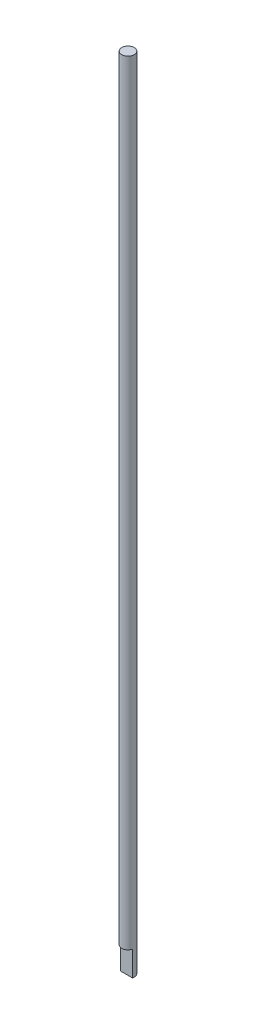
ISO-10303-21;
HEADER;
FILE_DESCRIPTION(('STEP AP214'),'2;1');
FILE_NAME('part.step','',(''),(''),'','','');
FILE_SCHEMA(('AUTOMOTIVE_DESIGN { 1 0 10303 214 1 1 1 1 }'));
ENDSEC;
DATA;
#1=APPLICATION_CONTEXT('core data for automotive mechanical design processes');
#2=APPLICATION_PROTOCOL_DEFINITION('international standard','automotive_design',2000,#1);
#3=PRODUCT_CONTEXT('',#1,'mechanical');
#4=PRODUCT('Part','Part','',(#3));
#5=PRODUCT_RELATED_PRODUCT_CATEGORY('part','',(#4));
#6=PRODUCT_DEFINITION_FORMATION('','',#4);
#7=PRODUCT_DEFINITION_CONTEXT('part definition',#1,'design');
#8=PRODUCT_DEFINITION('design','',#6,#7);
#9=PRODUCT_DEFINITION_SHAPE('','',#8);
#10=(LENGTH_UNIT() NAMED_UNIT(*) SI_UNIT(.MILLI.,.METRE.));
#11=(NAMED_UNIT(*) PLANE_ANGLE_UNIT() SI_UNIT($,.RADIAN.));
#12=(NAMED_UNIT(*) SI_UNIT($,.STERADIAN.) SOLID_ANGLE_UNIT());
#13=UNCERTAINTY_MEASURE_WITH_UNIT(LENGTH_MEASURE(1.E-05),#10,'distance_accuracy_value','');
#14=(GEOMETRIC_REPRESENTATION_CONTEXT(3) GLOBAL_UNCERTAINTY_ASSIGNED_CONTEXT((#13)) GLOBAL_UNIT_ASSIGNED_CONTEXT((#10,
#11,#12)) REPRESENTATION_CONTEXT('',''));
#15=CARTESIAN_POINT('',(0.,0.,0.));
#16=DIRECTION('',(0.,0.,1.));
#17=DIRECTION('',(1.,0.,0.));
#18=AXIS2_PLACEMENT_3D('',#15,#16,#17);
#19=CARTESIAN_POINT('',(0.,406.4,0.));
#20=DIRECTION('',(0.,-1.,0.));
#21=DIRECTION('',(0.,0.,-1.));
#22=AXIS2_PLACEMENT_3D('',#19,#20,#21);
#23=CYLINDRICAL_SURFACE('',#22,3.175);
#24=CARTESIAN_POINT('',(0.,406.4,0.));
#25=DIRECTION('',(0.,1.,0.));
#26=DIRECTION('',(0.,0.,1.));
#27=AXIS2_PLACEMENT_3D('',#24,#25,#26);
#28=CIRCLE('',#27,3.175);
#29=CARTESIAN_POINT('',(0.,406.4,3.175));
#30=VERTEX_POINT('',#29);
#31=EDGE_CURVE('E64',#30,#30,#28,.T.);
#32=ORIENTED_EDGE('',*,*,#31,.F.);
#33=EDGE_LOOP('',(#32));
#34=FACE_BOUND('',#33,.T.);
#35=CARTESIAN_POINT('',(0.,12.7,0.));
#36=DIRECTION('',(0.,1.,0.));
#37=DIRECTION('',(0.,0.,1.));
#38=AXIS2_PLACEMENT_3D('',#35,#36,#37);
#39=CIRCLE('',#38,3.175);
#40=CARTESIAN_POINT('',(-3.07845578766629,12.7,0.777003837431904));
#41=VERTEX_POINT('',#40);
#42=CARTESIAN_POINT('',(3.07845578766629,12.7,0.777003837431904));
#43=VERTEX_POINT('',#42);
#44=EDGE_CURVE('E11',#41,#43,#39,.T.);
#45=ORIENTED_EDGE('',*,*,#44,.T.);
#46=DIRECTION('',(0.,-1.,0.));
#47=VECTOR('',#46,1.);
#48=CARTESIAN_POINT('',(3.07845578766629,406.4,0.777003837431904));
#49=LINE('',#48,#47);
#50=CARTESIAN_POINT('',(3.07845578766629,0.,0.777003837431904));
#51=VERTEX_POINT('',#50);
#52=EDGE_CURVE('E54',#43,#51,#49,.T.);
#53=ORIENTED_EDGE('',*,*,#52,.T.);
#54=CARTESIAN_POINT('',(0.,0.,0.));
#55=DIRECTION('',(0.,1.,0.));
#56=DIRECTION('',(0.,0.,1.));
#57=AXIS2_PLACEMENT_3D('',#54,#55,#56);
#58=CIRCLE('',#57,3.175);
#59=CARTESIAN_POINT('',(-3.07845578766629,0.,0.777003837431904));
#60=VERTEX_POINT('',#59);
#61=EDGE_CURVE('E66',#51,#60,#58,.T.);
#62=ORIENTED_EDGE('',*,*,#61,.T.);
#63=DIRECTION('',(0.,-1.,0.));
#64=VECTOR('',#63,1.);
#65=CARTESIAN_POINT('',(-3.07845578766629,406.4,0.777003837431904));
#66=LINE('',#65,#64);
#67=EDGE_CURVE('E49',#60,#41,#66,.F.);
#68=ORIENTED_EDGE('',*,*,#67,.T.);
#69=EDGE_LOOP('',(#45,#53,#62,#68));
#70=FACE_BOUND('',#69,.T.);
#71=ADVANCED_FACE('F35',(#34,#70),#23,.T.);
#72=CARTESIAN_POINT('',(0.,406.4,0.));
#73=DIRECTION('',(0.,1.,0.));
#74=DIRECTION('',(0.,0.,1.));
#75=AXIS2_PLACEMENT_3D('',#72,#73,#74);
#76=PLANE('',#75);
#77=ORIENTED_EDGE('',*,*,#31,.T.);
#78=EDGE_LOOP('',(#77));
#79=FACE_BOUND('',#78,.T.);
#80=ADVANCED_FACE('F84',(#79),#76,.T.);
#81=CARTESIAN_POINT('',(0.,0.,0.));
#82=DIRECTION('',(0.,1.,0.));
#83=DIRECTION('',(0.,0.,1.));
#84=AXIS2_PLACEMENT_3D('',#81,#82,#83);
#85=PLANE('',#84);
#86=ORIENTED_EDGE('',*,*,#61,.F.);
#87=DIRECTION('',(-1.,0.,0.));
#88=VECTOR('',#87,1.);
#89=CARTESIAN_POINT('',(0.,0.,0.777003837431904));
#90=LINE('',#89,#88);
#91=EDGE_CURVE('E42',#51,#60,#90,.T.);
#92=ORIENTED_EDGE('',*,*,#91,.T.);
#93=EDGE_LOOP('',(#86,#92));
#94=FACE_BOUND('',#93,.T.);
#95=ADVANCED_FACE('F68',(#94),#85,.F.);
#96=CARTESIAN_POINT('',(0.,12.7,0.));
#97=DIRECTION('',(0.,1.,0.));
#98=DIRECTION('',(0.,0.,1.));
#99=AXIS2_PLACEMENT_3D('',#96,#97,#98);
#100=PLANE('',#99);
#101=DIRECTION('',(1.,0.,0.));
#102=VECTOR('',#101,1.);
#103=CARTESIAN_POINT('',(-3.78171809894258,12.7,0.777003837431904));
#104=LINE('',#103,#102);
#105=EDGE_CURVE('E74',#41,#43,#104,.T.);
#106=ORIENTED_EDGE('',*,*,#105,.T.);
#107=ORIENTED_EDGE('',*,*,#44,.F.);
#108=EDGE_LOOP('',(#106,#107));
#109=FACE_BOUND('',#108,.T.);
#110=ADVANCED_FACE('F76',(#109),#100,.F.);
#111=CARTESIAN_POINT('',(-3.78171809894258,12.7,0.777003837431904));
#112=DIRECTION('',(0.,0.,-1.));
#113=DIRECTION('',(-1.,0.,0.));
#114=AXIS2_PLACEMENT_3D('',#111,#112,#113);
#115=PLANE('',#114);
#116=ORIENTED_EDGE('',*,*,#105,.F.);
#117=ORIENTED_EDGE('',*,*,#67,.F.);
#118=ORIENTED_EDGE('',*,*,#91,.F.);
#119=ORIENTED_EDGE('',*,*,#52,.F.);
#120=EDGE_LOOP('',(#116,#117,#118,#119));
#121=FACE_BOUND('',#120,.T.);
#122=ADVANCED_FACE('F60',(#121),#115,.F.);
#123=CLOSED_SHELL('',(#71,#80,#95,#110,#122));
#124=MANIFOLD_SOLID_BREP('B2',#123);
#125=ADVANCED_BREP_SHAPE_REPRESENTATION('',(#18,#124),#14);
#126=SHAPE_DEFINITION_REPRESENTATION(#9,#125);
ENDSEC;
END-ISO-10303-21;
